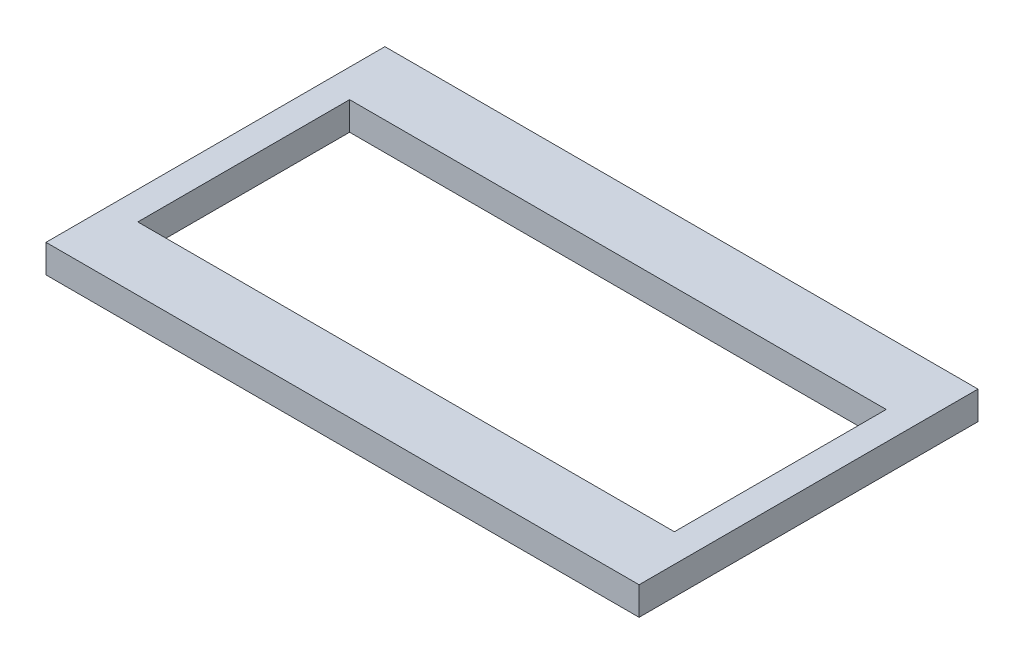
ISO-10303-21;
HEADER;
FILE_DESCRIPTION(('STEP AP214'),'2;1');
FILE_NAME('part.step','',(''),(''),'','','');
FILE_SCHEMA(('AUTOMOTIVE_DESIGN { 1 0 10303 214 1 1 1 1 }'));
ENDSEC;
DATA;
#1=APPLICATION_CONTEXT('core data for automotive mechanical design processes');
#2=APPLICATION_PROTOCOL_DEFINITION('international standard','automotive_design',2000,#1);
#3=PRODUCT_CONTEXT('',#1,'mechanical');
#4=PRODUCT('Part','Part','',(#3));
#5=PRODUCT_RELATED_PRODUCT_CATEGORY('part','',(#4));
#6=PRODUCT_DEFINITION_FORMATION('','',#4);
#7=PRODUCT_DEFINITION_CONTEXT('part definition',#1,'design');
#8=PRODUCT_DEFINITION('design','',#6,#7);
#9=PRODUCT_DEFINITION_SHAPE('','',#8);
#10=(LENGTH_UNIT() NAMED_UNIT(*) SI_UNIT(.MILLI.,.METRE.));
#11=(NAMED_UNIT(*) PLANE_ANGLE_UNIT() SI_UNIT($,.RADIAN.));
#12=(NAMED_UNIT(*) SI_UNIT($,.STERADIAN.) SOLID_ANGLE_UNIT());
#13=UNCERTAINTY_MEASURE_WITH_UNIT(LENGTH_MEASURE(1.E-05),#10,'distance_accuracy_value','');
#14=(GEOMETRIC_REPRESENTATION_CONTEXT(3) GLOBAL_UNCERTAINTY_ASSIGNED_CONTEXT((#13)) GLOBAL_UNIT_ASSIGNED_CONTEXT((#10,
#11,#12)) REPRESENTATION_CONTEXT('',''));
#15=CARTESIAN_POINT('',(0.,0.,0.));
#16=DIRECTION('',(0.,0.,1.));
#17=DIRECTION('',(1.,0.,0.));
#18=AXIS2_PLACEMENT_3D('',#15,#16,#17);
#19=CARTESIAN_POINT('',(-53.34,5.08,30.48));
#20=DIRECTION('',(0.,-1.,0.));
#21=DIRECTION('',(0.,0.,-1.));
#22=AXIS2_PLACEMENT_3D('',#19,#20,#21);
#23=PLANE('',#22);
#24=DIRECTION('',(0.,0.,1.));
#25=VECTOR('',#24,1.);
#26=CARTESIAN_POINT('',(-53.34,5.08,-30.48));
#27=LINE('',#26,#25);
#28=CARTESIAN_POINT('',(-53.34,5.08,-30.48));
#29=VERTEX_POINT('',#28);
#30=CARTESIAN_POINT('',(-53.34,5.08,30.48));
#31=VERTEX_POINT('',#30);
#32=EDGE_CURVE('E133',#29,#31,#27,.T.);
#33=ORIENTED_EDGE('',*,*,#32,.T.);
#34=DIRECTION('',(1.,0.,0.));
#35=VECTOR('',#34,1.);
#36=CARTESIAN_POINT('',(53.34,5.08,30.48));
#37=LINE('',#36,#35);
#38=CARTESIAN_POINT('',(53.34,5.08,30.48));
#39=VERTEX_POINT('',#38);
#40=EDGE_CURVE('E136',#31,#39,#37,.T.);
#41=ORIENTED_EDGE('',*,*,#40,.T.);
#42=DIRECTION('',(0.,0.,-1.));
#43=VECTOR('',#42,1.);
#44=CARTESIAN_POINT('',(53.34,5.08,-30.48));
#45=LINE('',#44,#43);
#46=CARTESIAN_POINT('',(53.34,5.08,-30.48));
#47=VERTEX_POINT('',#46);
#48=EDGE_CURVE('E139',#39,#47,#45,.T.);
#49=ORIENTED_EDGE('',*,*,#48,.T.);
#50=DIRECTION('',(-1.,0.,0.));
#51=VECTOR('',#50,1.);
#52=CARTESIAN_POINT('',(53.34,5.08,-30.48));
#53=LINE('',#52,#51);
#54=EDGE_CURVE('E141',#47,#29,#53,.T.);
#55=ORIENTED_EDGE('',*,*,#54,.T.);
#56=EDGE_LOOP('',(#33,#41,#49,#55));
#57=FACE_BOUND('',#56,.T.);
#58=DIRECTION('',(0.,0.,1.));
#59=VECTOR('',#58,1.);
#60=CARTESIAN_POINT('',(-48.26,5.08,-19.05));
#61=LINE('',#60,#59);
#62=CARTESIAN_POINT('',(-48.26,5.08,-19.05));
#63=VERTEX_POINT('',#62);
#64=CARTESIAN_POINT('',(-48.26,5.08,19.05));
#65=VERTEX_POINT('',#64);
#66=EDGE_CURVE('E97',#63,#65,#61,.T.);
#67=ORIENTED_EDGE('',*,*,#66,.F.);
#68=DIRECTION('',(-1.,0.,0.));
#69=VECTOR('',#68,1.);
#70=CARTESIAN_POINT('',(48.26,5.08,-19.05));
#71=LINE('',#70,#69);
#72=CARTESIAN_POINT('',(48.26,5.08,-19.05));
#73=VERTEX_POINT('',#72);
#74=EDGE_CURVE('E119',#73,#63,#71,.T.);
#75=ORIENTED_EDGE('',*,*,#74,.F.);
#76=DIRECTION('',(0.,0.,-1.));
#77=VECTOR('',#76,1.);
#78=CARTESIAN_POINT('',(48.26,5.08,-19.05));
#79=LINE('',#78,#77);
#80=CARTESIAN_POINT('',(48.26,5.08,19.05));
#81=VERTEX_POINT('',#80);
#82=EDGE_CURVE('E117',#81,#73,#79,.T.);
#83=ORIENTED_EDGE('',*,*,#82,.F.);
#84=DIRECTION('',(1.,0.,0.));
#85=VECTOR('',#84,1.);
#86=CARTESIAN_POINT('',(48.26,5.08,19.05));
#87=LINE('',#86,#85);
#88=EDGE_CURVE('E105',#65,#81,#87,.T.);
#89=ORIENTED_EDGE('',*,*,#88,.F.);
#90=EDGE_LOOP('',(#67,#75,#83,#89));
#91=FACE_BOUND('',#90,.T.);
#92=ADVANCED_FACE('F32',(#57,#91),#23,.F.);
#93=CARTESIAN_POINT('',(-53.34,0.,30.48));
#94=DIRECTION('',(0.,-1.,0.));
#95=DIRECTION('',(0.,0.,-1.));
#96=AXIS2_PLACEMENT_3D('',#93,#94,#95);
#97=PLANE('',#96);
#98=DIRECTION('',(0.,0.,1.));
#99=VECTOR('',#98,1.);
#100=CARTESIAN_POINT('',(-53.34,0.,-30.48));
#101=LINE('',#100,#99);
#102=CARTESIAN_POINT('',(-53.34,0.,-30.48));
#103=VERTEX_POINT('',#102);
#104=CARTESIAN_POINT('',(-53.34,0.,30.48));
#105=VERTEX_POINT('',#104);
#106=EDGE_CURVE('E113',#103,#105,#101,.T.);
#107=ORIENTED_EDGE('',*,*,#106,.F.);
#108=DIRECTION('',(-1.,0.,0.));
#109=VECTOR('',#108,1.);
#110=CARTESIAN_POINT('',(53.34,0.,-30.48));
#111=LINE('',#110,#109);
#112=CARTESIAN_POINT('',(53.34,0.,-30.48));
#113=VERTEX_POINT('',#112);
#114=EDGE_CURVE('E137',#113,#103,#111,.T.);
#115=ORIENTED_EDGE('',*,*,#114,.F.);
#116=DIRECTION('',(0.,0.,-1.));
#117=VECTOR('',#116,1.);
#118=CARTESIAN_POINT('',(53.34,0.,-30.48));
#119=LINE('',#118,#117);
#120=CARTESIAN_POINT('',(53.34,0.,30.48));
#121=VERTEX_POINT('',#120);
#122=EDGE_CURVE('E148',#121,#113,#119,.T.);
#123=ORIENTED_EDGE('',*,*,#122,.F.);
#124=DIRECTION('',(1.,0.,0.));
#125=VECTOR('',#124,1.);
#126=CARTESIAN_POINT('',(53.34,0.,30.48));
#127=LINE('',#126,#125);
#128=EDGE_CURVE('E146',#105,#121,#127,.T.);
#129=ORIENTED_EDGE('',*,*,#128,.F.);
#130=EDGE_LOOP('',(#107,#115,#123,#129));
#131=FACE_BOUND('',#130,.T.);
#132=DIRECTION('',(-1.,0.,0.));
#133=VECTOR('',#132,1.);
#134=CARTESIAN_POINT('',(48.26,0.,-19.05));
#135=LINE('',#134,#133);
#136=CARTESIAN_POINT('',(48.26,0.,-19.05));
#137=VERTEX_POINT('',#136);
#138=CARTESIAN_POINT('',(-48.26,0.,-19.05));
#139=VERTEX_POINT('',#138);
#140=EDGE_CURVE('E106',#137,#139,#135,.T.);
#141=ORIENTED_EDGE('',*,*,#140,.T.);
#142=DIRECTION('',(0.,0.,1.));
#143=VECTOR('',#142,1.);
#144=CARTESIAN_POINT('',(-48.26,0.,-19.05));
#145=LINE('',#144,#143);
#146=CARTESIAN_POINT('',(-48.26,0.,19.05));
#147=VERTEX_POINT('',#146);
#148=EDGE_CURVE('E55',#139,#147,#145,.T.);
#149=ORIENTED_EDGE('',*,*,#148,.T.);
#150=DIRECTION('',(1.,0.,0.));
#151=VECTOR('',#150,1.);
#152=CARTESIAN_POINT('',(48.26,0.,19.05));
#153=LINE('',#152,#151);
#154=CARTESIAN_POINT('',(48.26,0.,19.05));
#155=VERTEX_POINT('',#154);
#156=EDGE_CURVE('E112',#147,#155,#153,.T.);
#157=ORIENTED_EDGE('',*,*,#156,.T.);
#158=DIRECTION('',(0.,0.,-1.));
#159=VECTOR('',#158,1.);
#160=CARTESIAN_POINT('',(48.26,0.,-19.05));
#161=LINE('',#160,#159);
#162=EDGE_CURVE('E125',#155,#137,#161,.T.);
#163=ORIENTED_EDGE('',*,*,#162,.T.);
#164=EDGE_LOOP('',(#141,#149,#157,#163));
#165=FACE_BOUND('',#164,.T.);
#166=ADVANCED_FACE('F166',(#131,#165),#97,.T.);
#167=CARTESIAN_POINT('',(-53.34,5.08,-30.48));
#168=DIRECTION('',(1.,0.,0.));
#169=DIRECTION('',(0.,0.,-1.));
#170=AXIS2_PLACEMENT_3D('',#167,#168,#169);
#171=PLANE('',#170);
#172=ORIENTED_EDGE('',*,*,#106,.T.);
#173=DIRECTION('',(0.,-1.,0.));
#174=VECTOR('',#173,1.);
#175=CARTESIAN_POINT('',(-53.34,5.08,30.48));
#176=LINE('',#175,#174);
#177=EDGE_CURVE('E11',#31,#105,#176,.T.);
#178=ORIENTED_EDGE('',*,*,#177,.F.);
#179=ORIENTED_EDGE('',*,*,#32,.F.);
#180=DIRECTION('',(0.,-1.,0.));
#181=VECTOR('',#180,1.);
#182=CARTESIAN_POINT('',(-53.34,5.08,-30.48));
#183=LINE('',#182,#181);
#184=EDGE_CURVE('E143',#29,#103,#183,.T.);
#185=ORIENTED_EDGE('',*,*,#184,.T.);
#186=EDGE_LOOP('',(#172,#178,#179,#185));
#187=FACE_BOUND('',#186,.T.);
#188=ADVANCED_FACE('F34',(#187),#171,.F.);
#189=CARTESIAN_POINT('',(53.34,5.08,30.48));
#190=DIRECTION('',(0.,0.,-1.));
#191=DIRECTION('',(-1.,0.,0.));
#192=AXIS2_PLACEMENT_3D('',#189,#190,#191);
#193=PLANE('',#192);
#194=ORIENTED_EDGE('',*,*,#128,.T.);
#195=DIRECTION('',(0.,-1.,0.));
#196=VECTOR('',#195,1.);
#197=CARTESIAN_POINT('',(53.34,5.08,30.48));
#198=LINE('',#197,#196);
#199=EDGE_CURVE('E40',#39,#121,#198,.T.);
#200=ORIENTED_EDGE('',*,*,#199,.F.);
#201=ORIENTED_EDGE('',*,*,#40,.F.);
#202=ORIENTED_EDGE('',*,*,#177,.T.);
#203=EDGE_LOOP('',(#194,#200,#201,#202));
#204=FACE_BOUND('',#203,.T.);
#205=ADVANCED_FACE('F176',(#204),#193,.F.);
#206=CARTESIAN_POINT('',(53.34,5.08,-30.48));
#207=DIRECTION('',(-1.,0.,0.));
#208=DIRECTION('',(0.,0.,1.));
#209=AXIS2_PLACEMENT_3D('',#206,#207,#208);
#210=PLANE('',#209);
#211=ORIENTED_EDGE('',*,*,#122,.T.);
#212=DIRECTION('',(0.,-1.,0.));
#213=VECTOR('',#212,1.);
#214=CARTESIAN_POINT('',(53.34,5.08,-30.48));
#215=LINE('',#214,#213);
#216=EDGE_CURVE('E153',#47,#113,#215,.T.);
#217=ORIENTED_EDGE('',*,*,#216,.F.);
#218=ORIENTED_EDGE('',*,*,#48,.F.);
#219=ORIENTED_EDGE('',*,*,#199,.T.);
#220=EDGE_LOOP('',(#211,#217,#218,#219));
#221=FACE_BOUND('',#220,.T.);
#222=ADVANCED_FACE('F160',(#221),#210,.F.);
#223=CARTESIAN_POINT('',(53.34,5.08,-30.48));
#224=DIRECTION('',(0.,0.,1.));
#225=DIRECTION('',(1.,0.,0.));
#226=AXIS2_PLACEMENT_3D('',#223,#224,#225);
#227=PLANE('',#226);
#228=ORIENTED_EDGE('',*,*,#114,.T.);
#229=ORIENTED_EDGE('',*,*,#184,.F.);
#230=ORIENTED_EDGE('',*,*,#54,.F.);
#231=ORIENTED_EDGE('',*,*,#216,.T.);
#232=EDGE_LOOP('',(#228,#229,#230,#231));
#233=FACE_BOUND('',#232,.T.);
#234=ADVANCED_FACE('F170',(#233),#227,.F.);
#235=CARTESIAN_POINT('',(-48.26,5.08,-19.05));
#236=DIRECTION('',(1.,0.,0.));
#237=DIRECTION('',(0.,0.,-1.));
#238=AXIS2_PLACEMENT_3D('',#235,#236,#237);
#239=PLANE('',#238);
#240=ORIENTED_EDGE('',*,*,#148,.F.);
#241=DIRECTION('',(0.,-1.,0.));
#242=VECTOR('',#241,1.);
#243=CARTESIAN_POINT('',(-48.26,5.08,-19.05));
#244=LINE('',#243,#242);
#245=EDGE_CURVE('E101',#63,#139,#244,.T.);
#246=ORIENTED_EDGE('',*,*,#245,.F.);
#247=ORIENTED_EDGE('',*,*,#66,.T.);
#248=DIRECTION('',(0.,-1.,0.));
#249=VECTOR('',#248,1.);
#250=CARTESIAN_POINT('',(-48.26,5.08,19.05));
#251=LINE('',#250,#249);
#252=EDGE_CURVE('E100',#65,#147,#251,.T.);
#253=ORIENTED_EDGE('',*,*,#252,.T.);
#254=EDGE_LOOP('',(#240,#246,#247,#253));
#255=FACE_BOUND('',#254,.T.);
#256=ADVANCED_FACE('F99',(#255),#239,.T.);
#257=CARTESIAN_POINT('',(48.26,5.08,19.05));
#258=DIRECTION('',(0.,0.,-1.));
#259=DIRECTION('',(-1.,0.,0.));
#260=AXIS2_PLACEMENT_3D('',#257,#258,#259);
#261=PLANE('',#260);
#262=ORIENTED_EDGE('',*,*,#156,.F.);
#263=ORIENTED_EDGE('',*,*,#252,.F.);
#264=ORIENTED_EDGE('',*,*,#88,.T.);
#265=DIRECTION('',(0.,-1.,0.));
#266=VECTOR('',#265,1.);
#267=CARTESIAN_POINT('',(48.26,5.08,19.05));
#268=LINE('',#267,#266);
#269=EDGE_CURVE('E114',#81,#155,#268,.T.);
#270=ORIENTED_EDGE('',*,*,#269,.T.);
#271=EDGE_LOOP('',(#262,#263,#264,#270));
#272=FACE_BOUND('',#271,.T.);
#273=ADVANCED_FACE('F109',(#272),#261,.T.);
#274=CARTESIAN_POINT('',(48.26,5.08,-19.05));
#275=DIRECTION('',(-1.,0.,0.));
#276=DIRECTION('',(0.,0.,1.));
#277=AXIS2_PLACEMENT_3D('',#274,#275,#276);
#278=PLANE('',#277);
#279=ORIENTED_EDGE('',*,*,#162,.F.);
#280=ORIENTED_EDGE('',*,*,#269,.F.);
#281=ORIENTED_EDGE('',*,*,#82,.T.);
#282=DIRECTION('',(0.,-1.,0.));
#283=VECTOR('',#282,1.);
#284=CARTESIAN_POINT('',(48.26,5.08,-19.05));
#285=LINE('',#284,#283);
#286=EDGE_CURVE('E47',#73,#137,#285,.T.);
#287=ORIENTED_EDGE('',*,*,#286,.T.);
#288=EDGE_LOOP('',(#279,#280,#281,#287));
#289=FACE_BOUND('',#288,.T.);
#290=ADVANCED_FACE('F199',(#289),#278,.T.);
#291=CARTESIAN_POINT('',(48.26,5.08,-19.05));
#292=DIRECTION('',(0.,0.,1.));
#293=DIRECTION('',(1.,0.,0.));
#294=AXIS2_PLACEMENT_3D('',#291,#292,#293);
#295=PLANE('',#294);
#296=ORIENTED_EDGE('',*,*,#140,.F.);
#297=ORIENTED_EDGE('',*,*,#286,.F.);
#298=ORIENTED_EDGE('',*,*,#74,.T.);
#299=ORIENTED_EDGE('',*,*,#245,.T.);
#300=EDGE_LOOP('',(#296,#297,#298,#299));
#301=FACE_BOUND('',#300,.T.);
#302=ADVANCED_FACE('F203',(#301),#295,.T.);
#303=CLOSED_SHELL('',(#92,#166,#188,#205,#222,#234,#256,#273,#290,#302));
#304=MANIFOLD_SOLID_BREP('B2',#303);
#305=ADVANCED_BREP_SHAPE_REPRESENTATION('',(#18,#304),#14);
#306=SHAPE_DEFINITION_REPRESENTATION(#9,#305);
ENDSEC;
END-ISO-10303-21;
